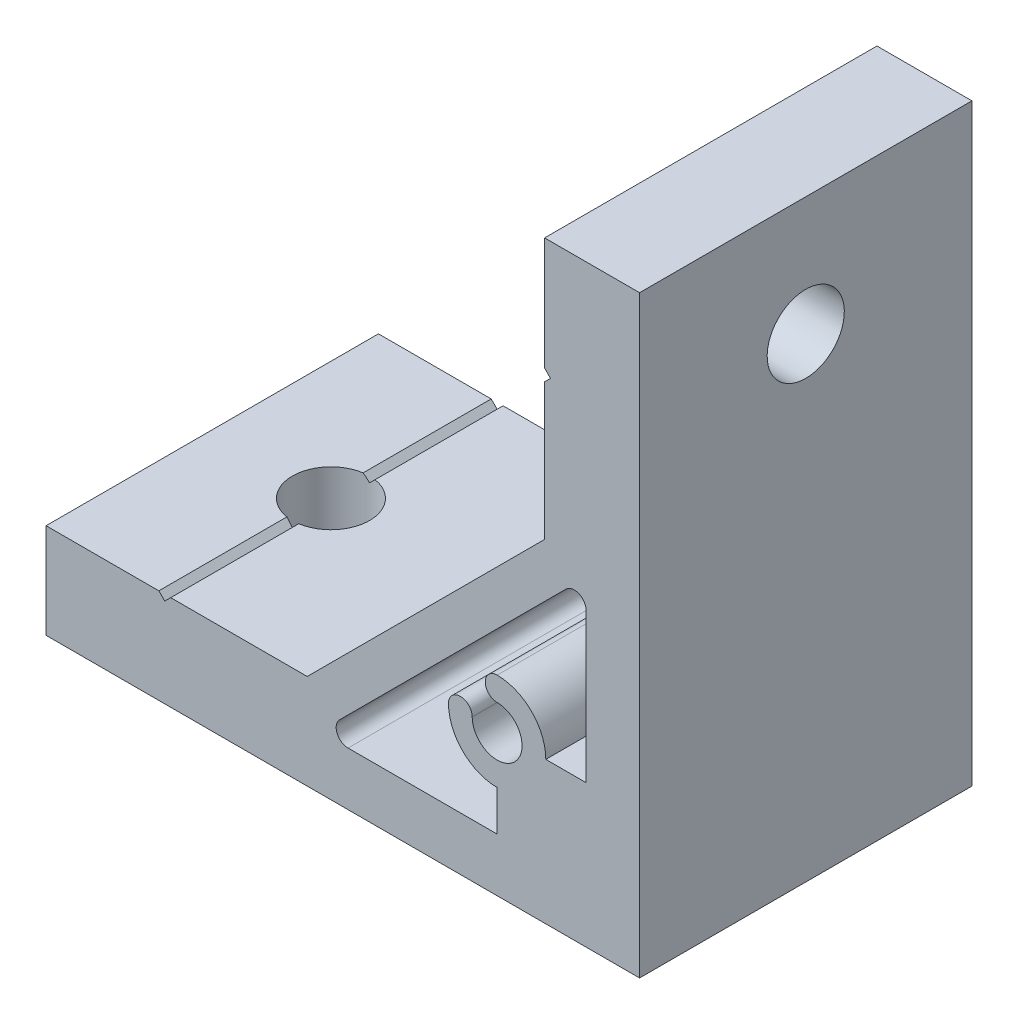
ISO-10303-21;
HEADER;
FILE_DESCRIPTION(('STEP AP214'),'2;1');
FILE_NAME('part.step','',(''),(''),'','','');
FILE_SCHEMA(('AUTOMOTIVE_DESIGN { 1 0 10303 214 1 1 1 1 }'));
ENDSEC;
DATA;
#1=APPLICATION_CONTEXT('core data for automotive mechanical design processes');
#2=APPLICATION_PROTOCOL_DEFINITION('international standard','automotive_design',2000,#1);
#3=PRODUCT_CONTEXT('',#1,'mechanical');
#4=PRODUCT('Part','Part','',(#3));
#5=PRODUCT_RELATED_PRODUCT_CATEGORY('part','',(#4));
#6=PRODUCT_DEFINITION_FORMATION('','',#4);
#7=PRODUCT_DEFINITION_CONTEXT('part definition',#1,'design');
#8=PRODUCT_DEFINITION('design','',#6,#7);
#9=PRODUCT_DEFINITION_SHAPE('','',#8);
#10=(LENGTH_UNIT() NAMED_UNIT(*) SI_UNIT(.MILLI.,.METRE.));
#11=(NAMED_UNIT(*) PLANE_ANGLE_UNIT() SI_UNIT($,.RADIAN.));
#12=(NAMED_UNIT(*) SI_UNIT($,.STERADIAN.) SOLID_ANGLE_UNIT());
#13=UNCERTAINTY_MEASURE_WITH_UNIT(LENGTH_MEASURE(1.E-05),#10,'distance_accuracy_value','');
#14=(GEOMETRIC_REPRESENTATION_CONTEXT(3) GLOBAL_UNCERTAINTY_ASSIGNED_CONTEXT((#13)) GLOBAL_UNIT_ASSIGNED_CONTEXT((#10,
#11,#12)) REPRESENTATION_CONTEXT('',''));
#15=CARTESIAN_POINT('',(0.,0.,0.));
#16=DIRECTION('',(0.,0.,1.));
#17=DIRECTION('',(1.,0.,0.));
#18=AXIS2_PLACEMENT_3D('',#15,#16,#17);
#19=CARTESIAN_POINT('',(-39.5,8.00000000000008,14.));
#20=DIRECTION('',(0.707106781186548,-0.707106781186548,0.));
#21=DIRECTION('',(0.707106781186548,0.707106781186548,0.));
#22=AXIS2_PLACEMENT_3D('',#19,#20,#21);
#23=PLANE('',#22);
#24=DIRECTION('',(0.,0.,-1.));
#25=VECTOR('',#24,1.);
#26=CARTESIAN_POINT('',(-39.5,8.00000000000008,14.));
#27=LINE('',#26,#25);
#28=CARTESIAN_POINT('',(-39.5,8.00000000000008,14.));
#29=VERTEX_POINT('',#28);
#30=CARTESIAN_POINT('',(-39.5,8.00000000000009,3.21130814466628));
#31=VERTEX_POINT('',#30);
#32=EDGE_CURVE('E264',#29,#31,#27,.T.);
#33=ORIENTED_EDGE('',*,*,#32,.T.);
#34=CARTESIAN_POINT('',(-40.,7.50000000000008,0.));
#35=DIRECTION('',(0.707106781186548,-0.707106781186548,0.));
#36=DIRECTION('',(0.707106781186548,0.707106781186548,0.));
#37=AXIS2_PLACEMENT_3D('',#34,#35,#36);
#38=ELLIPSE('',#37,4.59619407771252,3.25);
#39=CARTESIAN_POINT('',(-40.,7.50000000000008,3.25));
#40=VERTEX_POINT('',#39);
#41=EDGE_CURVE('E249',#31,#40,#38,.T.);
#42=ORIENTED_EDGE('',*,*,#41,.T.);
#43=DIRECTION('',(0.,0.,-1.));
#44=VECTOR('',#43,1.);
#45=CARTESIAN_POINT('',(-40.,7.50000000000008,14.));
#46=LINE('',#45,#44);
#47=CARTESIAN_POINT('',(-40.,7.50000000000008,14.));
#48=VERTEX_POINT('',#47);
#49=EDGE_CURVE('E248',#48,#40,#46,.T.);
#50=ORIENTED_EDGE('',*,*,#49,.F.);
#51=DIRECTION('',(-0.707106781186547,-0.707106781186547,0.));
#52=VECTOR('',#51,1.);
#53=CARTESIAN_POINT('',(-39.5,8.00000000000008,14.));
#54=LINE('',#53,#52);
#55=EDGE_CURVE('E365',#29,#48,#54,.T.);
#56=ORIENTED_EDGE('',*,*,#55,.F.);
#57=EDGE_LOOP('',(#33,#42,#50,#56));
#58=FACE_BOUND('',#57,.T.);
#59=ADVANCED_FACE('F34',(#58),#23,.F.);
#60=CARTESIAN_POINT('',(-40.,7.50000000000008,14.));
#61=DIRECTION('',(-0.707106781186549,-0.707106781186546,0.));
#62=DIRECTION('',(0.707106781186546,-0.707106781186549,0.));
#63=AXIS2_PLACEMENT_3D('',#60,#61,#62);
#64=PLANE('',#63);
#65=DIRECTION('',(0.,0.,-1.));
#66=VECTOR('',#65,1.);
#67=CARTESIAN_POINT('',(-40.5,8.00000000000008,14.));
#68=LINE('',#67,#66);
#69=CARTESIAN_POINT('',(-40.5,8.00000000000008,-3.21130814466628));
#70=VERTEX_POINT('',#69);
#71=CARTESIAN_POINT('',(-40.5,8.00000000000008,-14.));
#72=VERTEX_POINT('',#71);
#73=EDGE_CURVE('E256',#70,#72,#68,.T.);
#74=ORIENTED_EDGE('',*,*,#73,.F.);
#75=CARTESIAN_POINT('',(-40.,7.50000000000007,0.));
#76=DIRECTION('',(-0.707106781186549,-0.707106781186546,0.));
#77=DIRECTION('',(-0.707106781186546,0.707106781186549,0.));
#78=AXIS2_PLACEMENT_3D('',#75,#76,#77);
#79=ELLIPSE('',#78,4.59619407771261,3.25);
#80=CARTESIAN_POINT('',(-40.,7.50000000000008,-3.25));
#81=VERTEX_POINT('',#80);
#82=EDGE_CURVE('E49',#70,#81,#79,.T.);
#83=ORIENTED_EDGE('',*,*,#82,.T.);
#84=CARTESIAN_POINT('',(-40.,7.50000000000008,-14.));
#85=VERTEX_POINT('',#84);
#86=EDGE_CURVE('E255',#81,#85,#46,.T.);
#87=ORIENTED_EDGE('',*,*,#86,.T.);
#88=DIRECTION('',(-0.707106781186546,0.707106781186549,0.));
#89=VECTOR('',#88,1.);
#90=CARTESIAN_POINT('',(-40.,7.50000000000008,-14.));
#91=LINE('',#90,#89);
#92=EDGE_CURVE('E332',#85,#72,#91,.T.);
#93=ORIENTED_EDGE('',*,*,#92,.T.);
#94=EDGE_LOOP('',(#74,#83,#87,#93));
#95=FACE_BOUND('',#94,.T.);
#96=ADVANCED_FACE('F414',(#95),#64,.F.);
#97=CARTESIAN_POINT('',(-8.00000000000042,40.5,14.));
#98=DIRECTION('',(0.707106781186549,0.707106781186546,0.));
#99=DIRECTION('',(-0.707106781186546,0.707106781186549,0.));
#100=AXIS2_PLACEMENT_3D('',#97,#98,#99);
#101=PLANE('',#100);
#102=DIRECTION('',(0.,0.,-1.));
#103=VECTOR('',#102,1.);
#104=CARTESIAN_POINT('',(-8.00000000000042,40.5,14.));
#105=LINE('',#104,#103);
#106=CARTESIAN_POINT('',(-8.00000000000042,40.5,14.));
#107=VERTEX_POINT('',#106);
#108=CARTESIAN_POINT('',(-8.00000000000042,40.5,3.21130814466629));
#109=VERTEX_POINT('',#108);
#110=EDGE_CURVE('E282',#107,#109,#105,.T.);
#111=ORIENTED_EDGE('',*,*,#110,.T.);
#112=CARTESIAN_POINT('',(-7.50000000000042,40.,0.));
#113=DIRECTION('',(0.707106781186549,0.707106781186546,0.));
#114=DIRECTION('',(-0.707106781186546,0.707106781186549,0.));
#115=AXIS2_PLACEMENT_3D('',#112,#113,#114);
#116=ELLIPSE('',#115,4.59619407771271,3.25);
#117=CARTESIAN_POINT('',(-7.50000000000042,40.,3.25));
#118=VERTEX_POINT('',#117);
#119=EDGE_CURVE('E452',#109,#118,#116,.T.);
#120=ORIENTED_EDGE('',*,*,#119,.T.);
#121=DIRECTION('',(0.,0.,-1.));
#122=VECTOR('',#121,1.);
#123=CARTESIAN_POINT('',(-7.50000000000042,40.,14.));
#124=LINE('',#123,#122);
#125=CARTESIAN_POINT('',(-7.50000000000042,40.,14.));
#126=VERTEX_POINT('',#125);
#127=EDGE_CURVE('E278',#126,#118,#124,.T.);
#128=ORIENTED_EDGE('',*,*,#127,.F.);
#129=DIRECTION('',(0.707106781186546,-0.707106781186549,0.));
#130=VECTOR('',#129,1.);
#131=CARTESIAN_POINT('',(-8.00000000000042,40.5,14.));
#132=LINE('',#131,#130);
#133=EDGE_CURVE('E355',#107,#126,#132,.T.);
#134=ORIENTED_EDGE('',*,*,#133,.F.);
#135=EDGE_LOOP('',(#111,#120,#128,#134));
#136=FACE_BOUND('',#135,.T.);
#137=ADVANCED_FACE('F421',(#136),#101,.F.);
#138=CARTESIAN_POINT('',(-7.50000000000042,40.,14.));
#139=DIRECTION('',(0.707106781186549,-0.707106781186546,0.));
#140=DIRECTION('',(0.707106781186546,0.707106781186549,0.));
#141=AXIS2_PLACEMENT_3D('',#138,#139,#140);
#142=PLANE('',#141);
#143=DIRECTION('',(0.,0.,-1.));
#144=VECTOR('',#143,1.);
#145=CARTESIAN_POINT('',(-8.00000000000042,39.5,14.));
#146=LINE('',#145,#144);
#147=CARTESIAN_POINT('',(-8.00000000000042,39.5,-3.21130814466628));
#148=VERTEX_POINT('',#147);
#149=CARTESIAN_POINT('',(-8.00000000000042,39.5,-14.));
#150=VERTEX_POINT('',#149);
#151=EDGE_CURVE('E273',#148,#150,#146,.T.);
#152=ORIENTED_EDGE('',*,*,#151,.F.);
#153=CARTESIAN_POINT('',(-7.50000000000043,40.,0.));
#154=DIRECTION('',(0.707106781186549,-0.707106781186546,0.));
#155=DIRECTION('',(-0.707106781186546,-0.707106781186549,0.));
#156=AXIS2_PLACEMENT_3D('',#153,#154,#155);
#157=ELLIPSE('',#156,4.59619407771239,3.25);
#158=CARTESIAN_POINT('',(-7.50000000000042,40.,-3.25));
#159=VERTEX_POINT('',#158);
#160=EDGE_CURVE('E56',#148,#159,#157,.T.);
#161=ORIENTED_EDGE('',*,*,#160,.T.);
#162=CARTESIAN_POINT('',(-7.50000000000042,40.,-14.));
#163=VERTEX_POINT('',#162);
#164=EDGE_CURVE('E277',#159,#163,#124,.T.);
#165=ORIENTED_EDGE('',*,*,#164,.T.);
#166=DIRECTION('',(-0.707106781186546,-0.707106781186549,0.));
#167=VECTOR('',#166,1.);
#168=CARTESIAN_POINT('',(-7.50000000000042,40.,-14.));
#169=LINE('',#168,#167);
#170=EDGE_CURVE('E307',#163,#150,#169,.T.);
#171=ORIENTED_EDGE('',*,*,#170,.T.);
#172=EDGE_LOOP('',(#152,#161,#165,#171));
#173=FACE_BOUND('',#172,.T.);
#174=ADVANCED_FACE('F304',(#173),#142,.F.);
#175=CARTESIAN_POINT('',(0.,0.,14.));
#176=DIRECTION('',(0.,0.,1.));
#177=DIRECTION('',(1.,0.,0.));
#178=AXIS2_PLACEMENT_3D('',#175,#176,#177);
#179=PLANE('',#178);
#180=DIRECTION('',(0.,-1.,0.));
#181=VECTOR('',#180,1.);
#182=CARTESIAN_POINT('',(-50.,8.,14.));
#183=LINE('',#182,#181);
#184=CARTESIAN_POINT('',(-50.,8.,14.));
#185=VERTEX_POINT('',#184);
#186=CARTESIAN_POINT('',(-50.,0.,14.));
#187=VERTEX_POINT('',#186);
#188=EDGE_CURVE('E335',#185,#187,#183,.T.);
#189=ORIENTED_EDGE('',*,*,#188,.T.);
#190=DIRECTION('',(1.,0.,0.));
#191=VECTOR('',#190,1.);
#192=CARTESIAN_POINT('',(-50.,0.,14.));
#193=LINE('',#192,#191);
#194=CARTESIAN_POINT('',(0.,0.,14.));
#195=VERTEX_POINT('',#194);
#196=EDGE_CURVE('E339',#187,#195,#193,.T.);
#197=ORIENTED_EDGE('',*,*,#196,.T.);
#198=DIRECTION('',(0.,1.,0.));
#199=VECTOR('',#198,1.);
#200=CARTESIAN_POINT('',(0.,0.,14.));
#201=LINE('',#200,#199);
#202=CARTESIAN_POINT('',(0.,50.,14.));
#203=VERTEX_POINT('',#202);
#204=EDGE_CURVE('E344',#195,#203,#201,.T.);
#205=ORIENTED_EDGE('',*,*,#204,.T.);
#206=DIRECTION('',(-1.,0.,0.));
#207=VECTOR('',#206,1.);
#208=CARTESIAN_POINT('',(0.,50.,14.));
#209=LINE('',#208,#207);
#210=CARTESIAN_POINT('',(-8.00000000000009,50.,14.));
#211=VERTEX_POINT('',#210);
#212=EDGE_CURVE('E351',#203,#211,#209,.T.);
#213=ORIENTED_EDGE('',*,*,#212,.T.);
#214=DIRECTION('',(0.,-1.,0.));
#215=VECTOR('',#214,1.);
#216=CARTESIAN_POINT('',(-8.00000000000009,50.,14.));
#217=LINE('',#216,#215);
#218=EDGE_CURVE('E353',#211,#107,#217,.T.);
#219=ORIENTED_EDGE('',*,*,#218,.T.);
#220=ORIENTED_EDGE('',*,*,#133,.T.);
#221=DIRECTION('',(-0.707106781186546,-0.707106781186549,0.));
#222=VECTOR('',#221,1.);
#223=CARTESIAN_POINT('',(-7.50000000000042,40.,14.));
#224=LINE('',#223,#222);
#225=CARTESIAN_POINT('',(-8.00000000000042,39.5,14.));
#226=VERTEX_POINT('',#225);
#227=EDGE_CURVE('E357',#126,#226,#224,.T.);
#228=ORIENTED_EDGE('',*,*,#227,.T.);
#229=DIRECTION('',(0.,-1.,0.));
#230=VECTOR('',#229,1.);
#231=CARTESIAN_POINT('',(-8.00000000000042,39.5,14.));
#232=LINE('',#231,#230);
#233=CARTESIAN_POINT('',(-8.00000000000017,28.,14.));
#234=VERTEX_POINT('',#233);
#235=EDGE_CURVE('E359',#226,#234,#232,.T.);
#236=ORIENTED_EDGE('',*,*,#235,.T.);
#237=DIRECTION('',(-0.707106781186546,-0.707106781186549,0.));
#238=VECTOR('',#237,1.);
#239=CARTESIAN_POINT('',(-8.00000000000017,28.,14.));
#240=LINE('',#239,#238);
#241=CARTESIAN_POINT('',(-28.,8.00000000000008,14.));
#242=VERTEX_POINT('',#241);
#243=EDGE_CURVE('E361',#234,#242,#240,.T.);
#244=ORIENTED_EDGE('',*,*,#243,.T.);
#245=DIRECTION('',(-1.,0.,0.));
#246=VECTOR('',#245,1.);
#247=CARTESIAN_POINT('',(-28.,8.00000000000008,14.));
#248=LINE('',#247,#246);
#249=EDGE_CURVE('E363',#242,#29,#248,.T.);
#250=ORIENTED_EDGE('',*,*,#249,.T.);
#251=ORIENTED_EDGE('',*,*,#55,.T.);
#252=DIRECTION('',(-0.707106781186546,0.707106781186549,0.));
#253=VECTOR('',#252,1.);
#254=CARTESIAN_POINT('',(-40.,7.50000000000008,14.));
#255=LINE('',#254,#253);
#256=CARTESIAN_POINT('',(-40.5,8.00000000000008,14.));
#257=VERTEX_POINT('',#256);
#258=EDGE_CURVE('E367',#48,#257,#255,.T.);
#259=ORIENTED_EDGE('',*,*,#258,.T.);
#260=DIRECTION('',(-1.,0.,0.));
#261=VECTOR('',#260,1.);
#262=CARTESIAN_POINT('',(-40.5,8.00000000000008,14.));
#263=LINE('',#262,#261);
#264=EDGE_CURVE('E254',#257,#185,#263,.T.);
#265=ORIENTED_EDGE('',*,*,#264,.T.);
#266=EDGE_LOOP('',(#189,#197,#205,#213,#219,#220,#228,#236,#244,#250,#251,#259,#265));
#267=FACE_BOUND('',#266,.T.);
#268=DIRECTION('',(0.,1.,0.));
#269=VECTOR('',#268,1.);
#270=CARTESIAN_POINT('',(-4.5,12.,14.));
#271=LINE('',#270,#269);
#272=CARTESIAN_POINT('',(-4.5,12.,14.));
#273=VERTEX_POINT('',#272);
#274=CARTESIAN_POINT('',(-4.5,24.5603030380332,14.));
#275=VERTEX_POINT('',#274);
#276=EDGE_CURVE('E458',#273,#275,#271,.T.);
#277=ORIENTED_EDGE('',*,*,#276,.F.);
#278=DIRECTION('',(1.,0.,0.));
#279=VECTOR('',#278,1.);
#280=CARTESIAN_POINT('',(-7.9,12.,14.));
#281=LINE('',#280,#279);
#282=CARTESIAN_POINT('',(-7.9,12.,14.));
#283=VERTEX_POINT('',#282);
#284=EDGE_CURVE('E456',#283,#273,#281,.T.);
#285=ORIENTED_EDGE('',*,*,#284,.F.);
#286=CARTESIAN_POINT('',(-12.,12.,14.));
#287=DIRECTION('',(0.,0.,-1.));
#288=DIRECTION('',(-1.,0.,0.));
#289=AXIS2_PLACEMENT_3D('',#286,#287,#288);
#290=CIRCLE('',#289,4.1);
#291=CARTESIAN_POINT('',(-12.,16.1,14.));
#292=VERTEX_POINT('',#291);
#293=EDGE_CURVE('E480',#292,#283,#290,.T.);
#294=ORIENTED_EDGE('',*,*,#293,.F.);
#295=CARTESIAN_POINT('',(-12.,15.1,14.));
#296=DIRECTION('',(0.,0.,-1.));
#297=DIRECTION('',(-1.,0.,0.));
#298=AXIS2_PLACEMENT_3D('',#295,#296,#297);
#299=CIRCLE('',#298,1.);
#300=CARTESIAN_POINT('',(-12.,14.1,14.));
#301=VERTEX_POINT('',#300);
#302=EDGE_CURVE('E477',#301,#292,#299,.T.);
#303=ORIENTED_EDGE('',*,*,#302,.F.);
#304=CARTESIAN_POINT('',(-12.,12.,14.));
#305=DIRECTION('',(0.,0.,1.));
#306=DIRECTION('',(1.,0.,0.));
#307=AXIS2_PLACEMENT_3D('',#304,#305,#306);
#308=CIRCLE('',#307,2.1);
#309=CARTESIAN_POINT('',(-14.1,12.,14.));
#310=VERTEX_POINT('',#309);
#311=EDGE_CURVE('E475',#310,#301,#308,.T.);
#312=ORIENTED_EDGE('',*,*,#311,.F.);
#313=CARTESIAN_POINT('',(-15.1,12.,14.));
#314=DIRECTION('',(0.,0.,-1.));
#315=DIRECTION('',(-1.,0.,0.));
#316=AXIS2_PLACEMENT_3D('',#313,#314,#315);
#317=CIRCLE('',#316,1.);
#318=CARTESIAN_POINT('',(-16.1,12.,14.));
#319=VERTEX_POINT('',#318);
#320=EDGE_CURVE('E473',#319,#310,#317,.T.);
#321=ORIENTED_EDGE('',*,*,#320,.F.);
#322=CARTESIAN_POINT('',(-12.,12.,14.));
#323=DIRECTION('',(0.,0.,-1.));
#324=DIRECTION('',(-1.,0.,0.));
#325=AXIS2_PLACEMENT_3D('',#322,#323,#324);
#326=CIRCLE('',#325,4.1);
#327=CARTESIAN_POINT('',(-12.,7.9,14.));
#328=VERTEX_POINT('',#327);
#329=EDGE_CURVE('E471',#328,#319,#326,.T.);
#330=ORIENTED_EDGE('',*,*,#329,.F.);
#331=DIRECTION('',(0.,1.,0.));
#332=VECTOR('',#331,1.);
#333=CARTESIAN_POINT('',(-12.,4.5,14.));
#334=LINE('',#333,#332);
#335=CARTESIAN_POINT('',(-12.,4.5,14.));
#336=VERTEX_POINT('',#335);
#337=EDGE_CURVE('E469',#336,#328,#334,.T.);
#338=ORIENTED_EDGE('',*,*,#337,.F.);
#339=DIRECTION('',(1.,0.,0.));
#340=VECTOR('',#339,1.);
#341=CARTESIAN_POINT('',(-24.5603030380331,4.5,14.));
#342=LINE('',#341,#340);
#343=CARTESIAN_POINT('',(-24.5603030380331,4.5,14.));
#344=VERTEX_POINT('',#343);
#345=EDGE_CURVE('E467',#344,#336,#342,.T.);
#346=ORIENTED_EDGE('',*,*,#345,.F.);
#347=CARTESIAN_POINT('',(-24.5603030380331,5.5,14.));
#348=DIRECTION('',(0.,0.,1.));
#349=DIRECTION('',(1.,0.,0.));
#350=AXIS2_PLACEMENT_3D('',#347,#348,#349);
#351=CIRCLE('',#350,1.);
#352=CARTESIAN_POINT('',(-25.2674098192196,6.20710678118655,14.));
#353=VERTEX_POINT('',#352);
#354=EDGE_CURVE('E465',#353,#344,#351,.T.);
#355=ORIENTED_EDGE('',*,*,#354,.F.);
#356=DIRECTION('',(-0.707106781186546,-0.707106781186549,0.));
#357=VECTOR('',#356,1.);
#358=CARTESIAN_POINT('',(-6.20710678118655,25.2674098192197,14.));
#359=LINE('',#358,#357);
#360=CARTESIAN_POINT('',(-6.20710678118655,25.2674098192197,14.));
#361=VERTEX_POINT('',#360);
#362=EDGE_CURVE('E463',#361,#353,#359,.T.);
#363=ORIENTED_EDGE('',*,*,#362,.F.);
#364=CARTESIAN_POINT('',(-5.5,24.5603030380332,14.));
#365=DIRECTION('',(0.,0.,1.));
#366=DIRECTION('',(1.,0.,0.));
#367=AXIS2_PLACEMENT_3D('',#364,#365,#366);
#368=CIRCLE('',#367,0.999999999999999);
#369=EDGE_CURVE('E461',#275,#361,#368,.T.);
#370=ORIENTED_EDGE('',*,*,#369,.F.);
#371=EDGE_LOOP('',(#277,#285,#294,#303,#312,#321,#330,#338,#346,#355,#363,#370));
#372=FACE_BOUND('',#371,.T.);
#373=ADVANCED_FACE('F411',(#267,#372),#179,.T.);
#374=CARTESIAN_POINT('',(0.,0.,-14.));
#375=DIRECTION('',(0.,0.,1.));
#376=DIRECTION('',(1.,0.,0.));
#377=AXIS2_PLACEMENT_3D('',#374,#375,#376);
#378=PLANE('',#377);
#379=DIRECTION('',(0.,-1.,0.));
#380=VECTOR('',#379,1.);
#381=CARTESIAN_POINT('',(-50.,8.,-14.));
#382=LINE('',#381,#380);
#383=CARTESIAN_POINT('',(-50.,8.,-14.));
#384=VERTEX_POINT('',#383);
#385=CARTESIAN_POINT('',(-50.,0.,-14.));
#386=VERTEX_POINT('',#385);
#387=EDGE_CURVE('E370',#384,#386,#382,.T.);
#388=ORIENTED_EDGE('',*,*,#387,.F.);
#389=DIRECTION('',(-1.,0.,0.));
#390=VECTOR('',#389,1.);
#391=CARTESIAN_POINT('',(-40.5,8.00000000000008,-14.));
#392=LINE('',#391,#390);
#393=EDGE_CURVE('E334',#72,#384,#392,.T.);
#394=ORIENTED_EDGE('',*,*,#393,.F.);
#395=ORIENTED_EDGE('',*,*,#92,.F.);
#396=DIRECTION('',(-0.707106781186547,-0.707106781186547,0.));
#397=VECTOR('',#396,1.);
#398=CARTESIAN_POINT('',(-39.5,8.00000000000008,-14.));
#399=LINE('',#398,#397);
#400=CARTESIAN_POINT('',(-39.5,8.00000000000008,-14.));
#401=VERTEX_POINT('',#400);
#402=EDGE_CURVE('E329',#401,#85,#399,.T.);
#403=ORIENTED_EDGE('',*,*,#402,.F.);
#404=DIRECTION('',(-1.,0.,0.));
#405=VECTOR('',#404,1.);
#406=CARTESIAN_POINT('',(-28.,8.00000000000008,-14.));
#407=LINE('',#406,#405);
#408=CARTESIAN_POINT('',(-28.,8.00000000000008,-14.));
#409=VERTEX_POINT('',#408);
#410=EDGE_CURVE('E323',#409,#401,#407,.T.);
#411=ORIENTED_EDGE('',*,*,#410,.F.);
#412=DIRECTION('',(-0.707106781186546,-0.707106781186549,0.));
#413=VECTOR('',#412,1.);
#414=CARTESIAN_POINT('',(-8.00000000000017,28.,-14.));
#415=LINE('',#414,#413);
#416=CARTESIAN_POINT('',(-8.00000000000017,28.,-14.));
#417=VERTEX_POINT('',#416);
#418=EDGE_CURVE('E320',#417,#409,#415,.T.);
#419=ORIENTED_EDGE('',*,*,#418,.F.);
#420=DIRECTION('',(0.,-1.,0.));
#421=VECTOR('',#420,1.);
#422=CARTESIAN_POINT('',(-8.00000000000042,39.5,-14.));
#423=LINE('',#422,#421);
#424=EDGE_CURVE('E312',#150,#417,#423,.T.);
#425=ORIENTED_EDGE('',*,*,#424,.F.);
#426=ORIENTED_EDGE('',*,*,#170,.F.);
#427=DIRECTION('',(0.707106781186546,-0.707106781186549,0.));
#428=VECTOR('',#427,1.);
#429=CARTESIAN_POINT('',(-8.00000000000042,40.5,-14.));
#430=LINE('',#429,#428);
#431=CARTESIAN_POINT('',(-8.00000000000042,40.5,-14.));
#432=VERTEX_POINT('',#431);
#433=EDGE_CURVE('E313',#432,#163,#430,.T.);
#434=ORIENTED_EDGE('',*,*,#433,.F.);
#435=DIRECTION('',(0.,-1.,0.));
#436=VECTOR('',#435,1.);
#437=CARTESIAN_POINT('',(-8.00000000000009,50.,-14.));
#438=LINE('',#437,#436);
#439=CARTESIAN_POINT('',(-8.00000000000009,50.,-14.));
#440=VERTEX_POINT('',#439);
#441=EDGE_CURVE('E379',#440,#432,#438,.T.);
#442=ORIENTED_EDGE('',*,*,#441,.F.);
#443=DIRECTION('',(-1.,0.,0.));
#444=VECTOR('',#443,1.);
#445=CARTESIAN_POINT('',(0.,50.,-14.));
#446=LINE('',#445,#444);
#447=CARTESIAN_POINT('',(0.,50.,-14.));
#448=VERTEX_POINT('',#447);
#449=EDGE_CURVE('E377',#448,#440,#446,.T.);
#450=ORIENTED_EDGE('',*,*,#449,.F.);
#451=DIRECTION('',(0.,1.,0.));
#452=VECTOR('',#451,1.);
#453=CARTESIAN_POINT('',(0.,0.,-14.));
#454=LINE('',#453,#452);
#455=CARTESIAN_POINT('',(0.,0.,-14.));
#456=VERTEX_POINT('',#455);
#457=EDGE_CURVE('E375',#456,#448,#454,.T.);
#458=ORIENTED_EDGE('',*,*,#457,.F.);
#459=DIRECTION('',(1.,0.,0.));
#460=VECTOR('',#459,1.);
#461=CARTESIAN_POINT('',(-50.,0.,-14.));
#462=LINE('',#461,#460);
#463=EDGE_CURVE('E373',#386,#456,#462,.T.);
#464=ORIENTED_EDGE('',*,*,#463,.F.);
#465=EDGE_LOOP('',(#388,#394,#395,#403,#411,#419,#425,#426,#434,#442,#450,#458,#464));
#466=FACE_BOUND('',#465,.T.);
#467=DIRECTION('',(1.,0.,0.));
#468=VECTOR('',#467,1.);
#469=CARTESIAN_POINT('',(-7.9,12.,-14.));
#470=LINE('',#469,#468);
#471=CARTESIAN_POINT('',(-7.9,12.,-14.));
#472=VERTEX_POINT('',#471);
#473=CARTESIAN_POINT('',(-4.5,12.,-14.));
#474=VERTEX_POINT('',#473);
#475=EDGE_CURVE('E483',#472,#474,#470,.T.);
#476=ORIENTED_EDGE('',*,*,#475,.T.);
#477=DIRECTION('',(0.,1.,0.));
#478=VECTOR('',#477,1.);
#479=CARTESIAN_POINT('',(-4.5,12.,-14.));
#480=LINE('',#479,#478);
#481=CARTESIAN_POINT('',(-4.5,24.5603030380332,-14.));
#482=VERTEX_POINT('',#481);
#483=EDGE_CURVE('E486',#474,#482,#480,.T.);
#484=ORIENTED_EDGE('',*,*,#483,.T.);
#485=CARTESIAN_POINT('',(-5.5,24.5603030380332,-14.));
#486=DIRECTION('',(0.,0.,1.));
#487=DIRECTION('',(1.,0.,0.));
#488=AXIS2_PLACEMENT_3D('',#485,#486,#487);
#489=CIRCLE('',#488,0.999999999999999);
#490=CARTESIAN_POINT('',(-6.20710678118655,25.2674098192197,-14.));
#491=VERTEX_POINT('',#490);
#492=EDGE_CURVE('E489',#482,#491,#489,.T.);
#493=ORIENTED_EDGE('',*,*,#492,.T.);
#494=DIRECTION('',(-0.707106781186546,-0.707106781186549,0.));
#495=VECTOR('',#494,1.);
#496=CARTESIAN_POINT('',(-6.20710678118655,25.2674098192197,-14.));
#497=LINE('',#496,#495);
#498=CARTESIAN_POINT('',(-25.2674098192196,6.20710678118655,-14.));
#499=VERTEX_POINT('',#498);
#500=EDGE_CURVE('E492',#491,#499,#497,.T.);
#501=ORIENTED_EDGE('',*,*,#500,.T.);
#502=CARTESIAN_POINT('',(-24.5603030380331,5.5,-14.));
#503=DIRECTION('',(0.,0.,1.));
#504=DIRECTION('',(1.,0.,0.));
#505=AXIS2_PLACEMENT_3D('',#502,#503,#504);
#506=CIRCLE('',#505,1.);
#507=CARTESIAN_POINT('',(-24.5603030380331,4.5,-14.));
#508=VERTEX_POINT('',#507);
#509=EDGE_CURVE('E495',#499,#508,#506,.T.);
#510=ORIENTED_EDGE('',*,*,#509,.T.);
#511=DIRECTION('',(1.,0.,0.));
#512=VECTOR('',#511,1.);
#513=CARTESIAN_POINT('',(-24.5603030380331,4.5,-14.));
#514=LINE('',#513,#512);
#515=CARTESIAN_POINT('',(-12.,4.5,-14.));
#516=VERTEX_POINT('',#515);
#517=EDGE_CURVE('E498',#508,#516,#514,.T.);
#518=ORIENTED_EDGE('',*,*,#517,.T.);
#519=DIRECTION('',(0.,1.,0.));
#520=VECTOR('',#519,1.);
#521=CARTESIAN_POINT('',(-12.,4.5,-14.));
#522=LINE('',#521,#520);
#523=CARTESIAN_POINT('',(-12.,7.9,-14.));
#524=VERTEX_POINT('',#523);
#525=EDGE_CURVE('E501',#516,#524,#522,.T.);
#526=ORIENTED_EDGE('',*,*,#525,.T.);
#527=CARTESIAN_POINT('',(-12.,12.,-14.));
#528=DIRECTION('',(0.,0.,-1.));
#529=DIRECTION('',(-1.,0.,0.));
#530=AXIS2_PLACEMENT_3D('',#527,#528,#529);
#531=CIRCLE('',#530,4.1);
#532=CARTESIAN_POINT('',(-16.1,12.,-14.));
#533=VERTEX_POINT('',#532);
#534=EDGE_CURVE('E504',#524,#533,#531,.T.);
#535=ORIENTED_EDGE('',*,*,#534,.T.);
#536=CARTESIAN_POINT('',(-15.1,12.,-14.));
#537=DIRECTION('',(0.,0.,-1.));
#538=DIRECTION('',(-1.,0.,0.));
#539=AXIS2_PLACEMENT_3D('',#536,#537,#538);
#540=CIRCLE('',#539,1.);
#541=CARTESIAN_POINT('',(-14.1,12.,-14.));
#542=VERTEX_POINT('',#541);
#543=EDGE_CURVE('E507',#533,#542,#540,.T.);
#544=ORIENTED_EDGE('',*,*,#543,.T.);
#545=CARTESIAN_POINT('',(-12.,12.,-14.));
#546=DIRECTION('',(0.,0.,1.));
#547=DIRECTION('',(1.,0.,0.));
#548=AXIS2_PLACEMENT_3D('',#545,#546,#547);
#549=CIRCLE('',#548,2.1);
#550=CARTESIAN_POINT('',(-12.,14.1,-14.));
#551=VERTEX_POINT('',#550);
#552=EDGE_CURVE('E510',#542,#551,#549,.T.);
#553=ORIENTED_EDGE('',*,*,#552,.T.);
#554=CARTESIAN_POINT('',(-12.,15.1,-14.));
#555=DIRECTION('',(0.,0.,-1.));
#556=DIRECTION('',(-1.,0.,0.));
#557=AXIS2_PLACEMENT_3D('',#554,#555,#556);
#558=CIRCLE('',#557,1.);
#559=CARTESIAN_POINT('',(-12.,16.1,-14.));
#560=VERTEX_POINT('',#559);
#561=EDGE_CURVE('E513',#551,#560,#558,.T.);
#562=ORIENTED_EDGE('',*,*,#561,.T.);
#563=CARTESIAN_POINT('',(-12.,12.,-14.));
#564=DIRECTION('',(0.,0.,-1.));
#565=DIRECTION('',(-1.,0.,0.));
#566=AXIS2_PLACEMENT_3D('',#563,#564,#565);
#567=CIRCLE('',#566,4.1);
#568=EDGE_CURVE('E459',#560,#472,#567,.T.);
#569=ORIENTED_EDGE('',*,*,#568,.T.);
#570=EDGE_LOOP('',(#476,#484,#493,#501,#510,#518,#526,#535,#544,#553,#562,#569));
#571=FACE_BOUND('',#570,.T.);
#572=ADVANCED_FACE('F317',(#466,#571),#378,.F.);
#573=CARTESIAN_POINT('',(-50.,8.,14.));
#574=DIRECTION('',(1.,0.,0.));
#575=DIRECTION('',(0.,1.,0.));
#576=AXIS2_PLACEMENT_3D('',#573,#574,#575);
#577=PLANE('',#576);
#578=ORIENTED_EDGE('',*,*,#387,.T.);
#579=DIRECTION('',(0.,0.,-1.));
#580=VECTOR('',#579,1.);
#581=CARTESIAN_POINT('',(-50.,0.,14.));
#582=LINE('',#581,#580);
#583=EDGE_CURVE('E294',#187,#386,#582,.T.);
#584=ORIENTED_EDGE('',*,*,#583,.F.);
#585=ORIENTED_EDGE('',*,*,#188,.F.);
#586=DIRECTION('',(0.,0.,-1.));
#587=VECTOR('',#586,1.);
#588=CARTESIAN_POINT('',(-50.,8.,14.));
#589=LINE('',#588,#587);
#590=EDGE_CURVE('E259',#185,#384,#589,.T.);
#591=ORIENTED_EDGE('',*,*,#590,.T.);
#592=EDGE_LOOP('',(#578,#584,#585,#591));
#593=FACE_BOUND('',#592,.T.);
#594=ADVANCED_FACE('F36',(#593),#577,.F.);
#595=CARTESIAN_POINT('',(-50.,0.,14.));
#596=DIRECTION('',(0.,1.,0.));
#597=DIRECTION('',(-1.,0.,0.));
#598=AXIS2_PLACEMENT_3D('',#595,#596,#597);
#599=PLANE('',#598);
#600=CARTESIAN_POINT('',(-40.,-3.29597460435593E-13,0.));
#601=DIRECTION('',(0.,1.,0.));
#602=DIRECTION('',(-1.,0.,0.));
#603=AXIS2_PLACEMENT_3D('',#600,#601,#602);
#604=CIRCLE('',#603,3.25);
#605=CARTESIAN_POINT('',(-43.25,-3.56303071842079E-13,0.));
#606=VERTEX_POINT('',#605);
#607=EDGE_CURVE('E250',#606,#606,#604,.T.);
#608=ORIENTED_EDGE('',*,*,#607,.T.);
#609=EDGE_LOOP('',(#608));
#610=FACE_BOUND('',#609,.T.);
#611=ORIENTED_EDGE('',*,*,#463,.T.);
#612=DIRECTION('',(0.,0.,-1.));
#613=VECTOR('',#612,1.);
#614=CARTESIAN_POINT('',(0.,0.,14.));
#615=LINE('',#614,#613);
#616=EDGE_CURVE('E291',#195,#456,#615,.T.);
#617=ORIENTED_EDGE('',*,*,#616,.F.);
#618=ORIENTED_EDGE('',*,*,#196,.F.);
#619=ORIENTED_EDGE('',*,*,#583,.T.);
#620=EDGE_LOOP('',(#611,#617,#618,#619));
#621=FACE_BOUND('',#620,.T.);
#622=ADVANCED_FACE('F403',(#610,#621),#599,.F.);
#623=CARTESIAN_POINT('',(0.,0.,14.));
#624=DIRECTION('',(-1.,0.,0.));
#625=DIRECTION('',(0.,0.,1.));
#626=AXIS2_PLACEMENT_3D('',#623,#624,#625);
#627=PLANE('',#626);
#628=CARTESIAN_POINT('',(1.38777878078145E-12,39.9999999999998,0.));
#629=DIRECTION('',(-1.,0.,0.));
#630=DIRECTION('',(0.,-1.,0.));
#631=AXIS2_PLACEMENT_3D('',#628,#629,#630);
#632=CIRCLE('',#631,3.25);
#633=CARTESIAN_POINT('',(1.27502175484295E-12,36.7499999999998,0.));
#634=VERTEX_POINT('',#633);
#635=EDGE_CURVE('E446',#634,#634,#632,.T.);
#636=ORIENTED_EDGE('',*,*,#635,.T.);
#637=EDGE_LOOP('',(#636));
#638=FACE_BOUND('',#637,.T.);
#639=ORIENTED_EDGE('',*,*,#457,.T.);
#640=DIRECTION('',(0.,0.,-1.));
#641=VECTOR('',#640,1.);
#642=CARTESIAN_POINT('',(0.,50.,14.));
#643=LINE('',#642,#641);
#644=EDGE_CURVE('E288',#203,#448,#643,.T.);
#645=ORIENTED_EDGE('',*,*,#644,.F.);
#646=ORIENTED_EDGE('',*,*,#204,.F.);
#647=ORIENTED_EDGE('',*,*,#616,.T.);
#648=EDGE_LOOP('',(#639,#645,#646,#647));
#649=FACE_BOUND('',#648,.T.);
#650=ADVANCED_FACE('F400',(#638,#649),#627,.F.);
#651=CARTESIAN_POINT('',(0.,50.,14.));
#652=DIRECTION('',(0.,-1.,0.));
#653=DIRECTION('',(0.,0.,-1.));
#654=AXIS2_PLACEMENT_3D('',#651,#652,#653);
#655=PLANE('',#654);
#656=ORIENTED_EDGE('',*,*,#449,.T.);
#657=DIRECTION('',(0.,0.,-1.));
#658=VECTOR('',#657,1.);
#659=CARTESIAN_POINT('',(-8.00000000000009,50.,14.));
#660=LINE('',#659,#658);
#661=EDGE_CURVE('E285',#211,#440,#660,.T.);
#662=ORIENTED_EDGE('',*,*,#661,.F.);
#663=ORIENTED_EDGE('',*,*,#212,.F.);
#664=ORIENTED_EDGE('',*,*,#644,.T.);
#665=EDGE_LOOP('',(#656,#662,#663,#664));
#666=FACE_BOUND('',#665,.T.);
#667=ADVANCED_FACE('F396',(#666),#655,.F.);
#668=CARTESIAN_POINT('',(-8.00000000000009,50.,14.));
#669=DIRECTION('',(1.,0.,0.));
#670=DIRECTION('',(0.,1.,0.));
#671=AXIS2_PLACEMENT_3D('',#668,#669,#670);
#672=PLANE('',#671);
#673=CARTESIAN_POINT('',(-8.00000000000042,40.5,-3.21130814466629));
#674=VERTEX_POINT('',#673);
#675=EDGE_CURVE('E281',#674,#432,#105,.T.);
#676=ORIENTED_EDGE('',*,*,#675,.F.);
#677=CARTESIAN_POINT('',(-8.00000000000044,40.0000000000001,0.));
#678=DIRECTION('',(-1.,0.,0.));
#679=DIRECTION('',(0.,-1.,0.));
#680=AXIS2_PLACEMENT_3D('',#677,#678,#679);
#681=CIRCLE('',#680,3.25);
#682=EDGE_CURVE('E440',#109,#674,#681,.T.);
#683=ORIENTED_EDGE('',*,*,#682,.F.);
#684=ORIENTED_EDGE('',*,*,#110,.F.);
#685=ORIENTED_EDGE('',*,*,#218,.F.);
#686=ORIENTED_EDGE('',*,*,#661,.T.);
#687=ORIENTED_EDGE('',*,*,#441,.T.);
#688=EDGE_LOOP('',(#676,#683,#684,#685,#686,#687));
#689=FACE_BOUND('',#688,.T.);
#690=ADVANCED_FACE('F389',(#689),#672,.F.);
#691=ORIENTED_EDGE('',*,*,#164,.F.);
#692=EDGE_CURVE('E455',#159,#674,#116,.T.);
#693=ORIENTED_EDGE('',*,*,#692,.T.);
#694=ORIENTED_EDGE('',*,*,#675,.T.);
#695=ORIENTED_EDGE('',*,*,#433,.T.);
#696=EDGE_LOOP('',(#691,#693,#694,#695));
#697=FACE_BOUND('',#696,.T.);
#698=ADVANCED_FACE('F382',(#697),#101,.F.);
#699=ORIENTED_EDGE('',*,*,#127,.T.);
#700=CARTESIAN_POINT('',(-8.00000000000046,39.5,3.21130814466628));
#701=VERTEX_POINT('',#700);
#702=EDGE_CURVE('E449',#118,#701,#157,.T.);
#703=ORIENTED_EDGE('',*,*,#702,.T.);
#704=EDGE_CURVE('E274',#226,#701,#146,.T.);
#705=ORIENTED_EDGE('',*,*,#704,.F.);
#706=ORIENTED_EDGE('',*,*,#227,.F.);
#707=EDGE_LOOP('',(#699,#703,#705,#706));
#708=FACE_BOUND('',#707,.T.);
#709=ADVANCED_FACE('F706',(#708),#142,.F.);
#710=CARTESIAN_POINT('',(-8.00000000000042,39.5,14.));
#711=DIRECTION('',(1.,0.,0.));
#712=DIRECTION('',(0.,1.,0.));
#713=AXIS2_PLACEMENT_3D('',#710,#711,#712);
#714=PLANE('',#713);
#715=ORIENTED_EDGE('',*,*,#704,.T.);
#716=CARTESIAN_POINT('',(-8.00000000000043,40.0000000000001,0.));
#717=DIRECTION('',(1.,0.,0.));
#718=DIRECTION('',(0.,1.,0.));
#719=AXIS2_PLACEMENT_3D('',#716,#717,#718);
#720=CIRCLE('',#719,3.25);
#721=EDGE_CURVE('E42',#701,#148,#720,.T.);
#722=ORIENTED_EDGE('',*,*,#721,.T.);
#723=ORIENTED_EDGE('',*,*,#151,.T.);
#724=ORIENTED_EDGE('',*,*,#424,.T.);
#725=DIRECTION('',(0.,0.,-1.));
#726=VECTOR('',#725,1.);
#727=CARTESIAN_POINT('',(-8.00000000000017,28.,14.));
#728=LINE('',#727,#726);
#729=EDGE_CURVE('E270',#234,#417,#728,.T.);
#730=ORIENTED_EDGE('',*,*,#729,.F.);
#731=ORIENTED_EDGE('',*,*,#235,.F.);
#732=EDGE_LOOP('',(#715,#722,#723,#724,#730,#731));
#733=FACE_BOUND('',#732,.T.);
#734=ADVANCED_FACE('F298',(#733),#714,.F.);
#735=CARTESIAN_POINT('',(-8.00000000000017,28.,14.));
#736=DIRECTION('',(0.707106781186549,-0.707106781186546,0.));
#737=DIRECTION('',(0.707106781186546,0.707106781186549,0.));
#738=AXIS2_PLACEMENT_3D('',#735,#736,#737);
#739=PLANE('',#738);
#740=ORIENTED_EDGE('',*,*,#418,.T.);
#741=DIRECTION('',(0.,0.,-1.));
#742=VECTOR('',#741,1.);
#743=CARTESIAN_POINT('',(-28.,8.00000000000008,14.));
#744=LINE('',#743,#742);
#745=EDGE_CURVE('E267',#242,#409,#744,.T.);
#746=ORIENTED_EDGE('',*,*,#745,.F.);
#747=ORIENTED_EDGE('',*,*,#243,.F.);
#748=ORIENTED_EDGE('',*,*,#729,.T.);
#749=EDGE_LOOP('',(#740,#746,#747,#748));
#750=FACE_BOUND('',#749,.T.);
#751=ADVANCED_FACE('F432',(#750),#739,.F.);
#752=CARTESIAN_POINT('',(-28.,8.00000000000008,14.));
#753=DIRECTION('',(0.,-1.,0.));
#754=DIRECTION('',(1.,0.,0.));
#755=AXIS2_PLACEMENT_3D('',#752,#753,#754);
#756=PLANE('',#755);
#757=CARTESIAN_POINT('',(-39.5,8.00000000000009,-3.21130814466628));
#758=VERTEX_POINT('',#757);
#759=EDGE_CURVE('E263',#758,#401,#27,.T.);
#760=ORIENTED_EDGE('',*,*,#759,.F.);
#761=CARTESIAN_POINT('',(-40.,8.00000000000008,0.));
#762=DIRECTION('',(0.,1.,0.));
#763=DIRECTION('',(-1.,0.,0.));
#764=AXIS2_PLACEMENT_3D('',#761,#762,#763);
#765=CIRCLE('',#764,3.25);
#766=EDGE_CURVE('E443',#31,#758,#765,.T.);
#767=ORIENTED_EDGE('',*,*,#766,.F.);
#768=ORIENTED_EDGE('',*,*,#32,.F.);
#769=ORIENTED_EDGE('',*,*,#249,.F.);
#770=ORIENTED_EDGE('',*,*,#745,.T.);
#771=ORIENTED_EDGE('',*,*,#410,.T.);
#772=EDGE_LOOP('',(#760,#767,#768,#769,#770,#771));
#773=FACE_BOUND('',#772,.T.);
#774=ADVANCED_FACE('F426',(#773),#756,.F.);
#775=ORIENTED_EDGE('',*,*,#86,.F.);
#776=EDGE_CURVE('E436',#81,#758,#38,.T.);
#777=ORIENTED_EDGE('',*,*,#776,.T.);
#778=ORIENTED_EDGE('',*,*,#759,.T.);
#779=ORIENTED_EDGE('',*,*,#402,.T.);
#780=EDGE_LOOP('',(#775,#777,#778,#779));
#781=FACE_BOUND('',#780,.T.);
#782=ADVANCED_FACE('F417',(#781),#23,.F.);
#783=ORIENTED_EDGE('',*,*,#49,.T.);
#784=CARTESIAN_POINT('',(-40.5,8.00000000000008,3.21130814466628));
#785=VERTEX_POINT('',#784);
#786=EDGE_CURVE('E235',#40,#785,#79,.T.);
#787=ORIENTED_EDGE('',*,*,#786,.T.);
#788=EDGE_CURVE('E245',#257,#785,#68,.T.);
#789=ORIENTED_EDGE('',*,*,#788,.F.);
#790=ORIENTED_EDGE('',*,*,#258,.F.);
#791=EDGE_LOOP('',(#783,#787,#789,#790));
#792=FACE_BOUND('',#791,.T.);
#793=ADVANCED_FACE('F243',(#792),#64,.F.);
#794=CARTESIAN_POINT('',(-40.5,8.00000000000008,14.));
#795=DIRECTION('',(0.,-1.,0.));
#796=DIRECTION('',(1.,0.,0.));
#797=AXIS2_PLACEMENT_3D('',#794,#795,#796);
#798=PLANE('',#797);
#799=ORIENTED_EDGE('',*,*,#788,.T.);
#800=CARTESIAN_POINT('',(-40.,8.00000000000008,0.));
#801=DIRECTION('',(0.,-1.,0.));
#802=DIRECTION('',(1.,0.,0.));
#803=AXIS2_PLACEMENT_3D('',#800,#801,#802);
#804=CIRCLE('',#803,3.25);
#805=EDGE_CURVE('E11',#785,#70,#804,.T.);
#806=ORIENTED_EDGE('',*,*,#805,.T.);
#807=ORIENTED_EDGE('',*,*,#73,.T.);
#808=ORIENTED_EDGE('',*,*,#393,.T.);
#809=ORIENTED_EDGE('',*,*,#590,.F.);
#810=ORIENTED_EDGE('',*,*,#264,.F.);
#811=EDGE_LOOP('',(#799,#806,#807,#808,#809,#810));
#812=FACE_BOUND('',#811,.T.);
#813=ADVANCED_FACE('F252',(#812),#798,.F.);
#814=CARTESIAN_POINT('',(-7.9,12.,14.));
#815=DIRECTION('',(0.,1.,0.));
#816=DIRECTION('',(0.,0.,1.));
#817=AXIS2_PLACEMENT_3D('',#814,#815,#816);
#818=PLANE('',#817);
#819=ORIENTED_EDGE('',*,*,#475,.F.);
#820=DIRECTION('',(0.,0.,-1.));
#821=VECTOR('',#820,1.);
#822=CARTESIAN_POINT('',(-7.9,12.,14.));
#823=LINE('',#822,#821);
#824=EDGE_CURVE('E482',#283,#472,#823,.T.);
#825=ORIENTED_EDGE('',*,*,#824,.F.);
#826=ORIENTED_EDGE('',*,*,#284,.T.);
#827=DIRECTION('',(0.,0.,-1.));
#828=VECTOR('',#827,1.);
#829=CARTESIAN_POINT('',(-4.5,12.,14.));
#830=LINE('',#829,#828);
#831=EDGE_CURVE('E347',#273,#474,#830,.T.);
#832=ORIENTED_EDGE('',*,*,#831,.T.);
#833=EDGE_LOOP('',(#819,#825,#826,#832));
#834=FACE_BOUND('',#833,.T.);
#835=ADVANCED_FACE('F544',(#834),#818,.T.);
#836=CARTESIAN_POINT('',(-4.5,12.,14.));
#837=DIRECTION('',(-1.,0.,0.));
#838=DIRECTION('',(0.,-1.,0.));
#839=AXIS2_PLACEMENT_3D('',#836,#837,#838);
#840=PLANE('',#839);
#841=ORIENTED_EDGE('',*,*,#483,.F.);
#842=ORIENTED_EDGE('',*,*,#831,.F.);
#843=ORIENTED_EDGE('',*,*,#276,.T.);
#844=DIRECTION('',(0.,0.,-1.));
#845=VECTOR('',#844,1.);
#846=CARTESIAN_POINT('',(-4.5,24.5603030380332,14.));
#847=LINE('',#846,#845);
#848=EDGE_CURVE('E537',#275,#482,#847,.T.);
#849=ORIENTED_EDGE('',*,*,#848,.T.);
#850=EDGE_LOOP('',(#841,#842,#843,#849));
#851=FACE_BOUND('',#850,.T.);
#852=ADVANCED_FACE('F557',(#851),#840,.T.);
#853=CARTESIAN_POINT('',(-5.5,24.5603030380332,14.));
#854=DIRECTION('',(0.,0.,-1.));
#855=DIRECTION('',(-1.,0.,0.));
#856=AXIS2_PLACEMENT_3D('',#853,#854,#855);
#857=CYLINDRICAL_SURFACE('',#856,0.999999999999999);
#858=ORIENTED_EDGE('',*,*,#492,.F.);
#859=ORIENTED_EDGE('',*,*,#848,.F.);
#860=ORIENTED_EDGE('',*,*,#369,.T.);
#861=DIRECTION('',(0.,0.,-1.));
#862=VECTOR('',#861,1.);
#863=CARTESIAN_POINT('',(-6.20710678118655,25.2674098192197,14.));
#864=LINE('',#863,#862);
#865=EDGE_CURVE('E536',#361,#491,#864,.T.);
#866=ORIENTED_EDGE('',*,*,#865,.T.);
#867=EDGE_LOOP('',(#858,#859,#860,#866));
#868=FACE_BOUND('',#867,.T.);
#869=ADVANCED_FACE('F559',(#868),#857,.F.);
#870=CARTESIAN_POINT('',(-6.20710678118655,25.2674098192197,14.));
#871=DIRECTION('',(0.707106781186549,-0.707106781186546,0.));
#872=DIRECTION('',(0.707106781186546,0.707106781186549,0.));
#873=AXIS2_PLACEMENT_3D('',#870,#871,#872);
#874=PLANE('',#873);
#875=ORIENTED_EDGE('',*,*,#500,.F.);
#876=ORIENTED_EDGE('',*,*,#865,.F.);
#877=ORIENTED_EDGE('',*,*,#362,.T.);
#878=DIRECTION('',(0.,0.,-1.));
#879=VECTOR('',#878,1.);
#880=CARTESIAN_POINT('',(-25.2674098192196,6.20710678118655,14.));
#881=LINE('',#880,#879);
#882=EDGE_CURVE('E534',#353,#499,#881,.T.);
#883=ORIENTED_EDGE('',*,*,#882,.T.);
#884=EDGE_LOOP('',(#875,#876,#877,#883));
#885=FACE_BOUND('',#884,.T.);
#886=ADVANCED_FACE('F564',(#885),#874,.T.);
#887=CARTESIAN_POINT('',(-24.5603030380331,5.5,14.));
#888=DIRECTION('',(0.,0.,-1.));
#889=DIRECTION('',(-1.,0.,0.));
#890=AXIS2_PLACEMENT_3D('',#887,#888,#889);
#891=CYLINDRICAL_SURFACE('',#890,1.);
#892=ORIENTED_EDGE('',*,*,#509,.F.);
#893=ORIENTED_EDGE('',*,*,#882,.F.);
#894=ORIENTED_EDGE('',*,*,#354,.T.);
#895=DIRECTION('',(0.,0.,-1.));
#896=VECTOR('',#895,1.);
#897=CARTESIAN_POINT('',(-24.5603030380331,4.5,14.));
#898=LINE('',#897,#896);
#899=EDGE_CURVE('E532',#344,#508,#898,.T.);
#900=ORIENTED_EDGE('',*,*,#899,.T.);
#901=EDGE_LOOP('',(#892,#893,#894,#900));
#902=FACE_BOUND('',#901,.T.);
#903=ADVANCED_FACE('F568',(#902),#891,.F.);
#904=CARTESIAN_POINT('',(-24.5603030380331,4.5,14.));
#905=DIRECTION('',(0.,1.,0.));
#906=DIRECTION('',(0.,0.,1.));
#907=AXIS2_PLACEMENT_3D('',#904,#905,#906);
#908=PLANE('',#907);
#909=ORIENTED_EDGE('',*,*,#517,.F.);
#910=ORIENTED_EDGE('',*,*,#899,.F.);
#911=ORIENTED_EDGE('',*,*,#345,.T.);
#912=DIRECTION('',(0.,0.,-1.));
#913=VECTOR('',#912,1.);
#914=CARTESIAN_POINT('',(-12.,4.5,14.));
#915=LINE('',#914,#913);
#916=EDGE_CURVE('E530',#336,#516,#915,.T.);
#917=ORIENTED_EDGE('',*,*,#916,.T.);
#918=EDGE_LOOP('',(#909,#910,#911,#917));
#919=FACE_BOUND('',#918,.T.);
#920=ADVANCED_FACE('F573',(#919),#908,.T.);
#921=CARTESIAN_POINT('',(-12.,4.5,14.));
#922=DIRECTION('',(-1.,0.,0.));
#923=DIRECTION('',(0.,-1.,0.));
#924=AXIS2_PLACEMENT_3D('',#921,#922,#923);
#925=PLANE('',#924);
#926=ORIENTED_EDGE('',*,*,#525,.F.);
#927=ORIENTED_EDGE('',*,*,#916,.F.);
#928=ORIENTED_EDGE('',*,*,#337,.T.);
#929=DIRECTION('',(0.,0.,-1.));
#930=VECTOR('',#929,1.);
#931=CARTESIAN_POINT('',(-12.,7.9,14.));
#932=LINE('',#931,#930);
#933=EDGE_CURVE('E528',#328,#524,#932,.T.);
#934=ORIENTED_EDGE('',*,*,#933,.T.);
#935=EDGE_LOOP('',(#926,#927,#928,#934));
#936=FACE_BOUND('',#935,.T.);
#937=ADVANCED_FACE('F578',(#936),#925,.T.);
#938=CARTESIAN_POINT('',(-12.,12.,14.));
#939=DIRECTION('',(0.,0.,-1.));
#940=DIRECTION('',(-1.,0.,0.));
#941=AXIS2_PLACEMENT_3D('',#938,#939,#940);
#942=CYLINDRICAL_SURFACE('',#941,4.1);
#943=ORIENTED_EDGE('',*,*,#534,.F.);
#944=ORIENTED_EDGE('',*,*,#933,.F.);
#945=ORIENTED_EDGE('',*,*,#329,.T.);
#946=DIRECTION('',(0.,0.,-1.));
#947=VECTOR('',#946,1.);
#948=CARTESIAN_POINT('',(-16.1,12.,14.));
#949=LINE('',#948,#947);
#950=EDGE_CURVE('E526',#319,#533,#949,.T.);
#951=ORIENTED_EDGE('',*,*,#950,.T.);
#952=EDGE_LOOP('',(#943,#944,#945,#951));
#953=FACE_BOUND('',#952,.T.);
#954=ADVANCED_FACE('F583',(#953),#942,.T.);
#955=CARTESIAN_POINT('',(-15.1,12.,14.));
#956=DIRECTION('',(0.,0.,-1.));
#957=DIRECTION('',(-1.,0.,0.));
#958=AXIS2_PLACEMENT_3D('',#955,#956,#957);
#959=CYLINDRICAL_SURFACE('',#958,1.);
#960=ORIENTED_EDGE('',*,*,#543,.F.);
#961=ORIENTED_EDGE('',*,*,#950,.F.);
#962=ORIENTED_EDGE('',*,*,#320,.T.);
#963=DIRECTION('',(0.,0.,-1.));
#964=VECTOR('',#963,1.);
#965=CARTESIAN_POINT('',(-14.1,12.,14.));
#966=LINE('',#965,#964);
#967=EDGE_CURVE('E524',#310,#542,#966,.T.);
#968=ORIENTED_EDGE('',*,*,#967,.T.);
#969=EDGE_LOOP('',(#960,#961,#962,#968));
#970=FACE_BOUND('',#969,.T.);
#971=ADVANCED_FACE('F588',(#970),#959,.T.);
#972=CARTESIAN_POINT('',(-12.,12.,14.));
#973=DIRECTION('',(0.,0.,-1.));
#974=DIRECTION('',(-1.,0.,0.));
#975=AXIS2_PLACEMENT_3D('',#972,#973,#974);
#976=CYLINDRICAL_SURFACE('',#975,2.1);
#977=ORIENTED_EDGE('',*,*,#552,.F.);
#978=ORIENTED_EDGE('',*,*,#967,.F.);
#979=ORIENTED_EDGE('',*,*,#311,.T.);
#980=DIRECTION('',(0.,0.,-1.));
#981=VECTOR('',#980,1.);
#982=CARTESIAN_POINT('',(-12.,14.1,14.));
#983=LINE('',#982,#981);
#984=EDGE_CURVE('E522',#301,#551,#983,.T.);
#985=ORIENTED_EDGE('',*,*,#984,.T.);
#986=EDGE_LOOP('',(#977,#978,#979,#985));
#987=FACE_BOUND('',#986,.T.);
#988=ADVANCED_FACE('F592',(#987),#976,.F.);
#989=CARTESIAN_POINT('',(-12.,15.1,14.));
#990=DIRECTION('',(0.,0.,-1.));
#991=DIRECTION('',(-1.,0.,0.));
#992=AXIS2_PLACEMENT_3D('',#989,#990,#991);
#993=CYLINDRICAL_SURFACE('',#992,1.);
#994=ORIENTED_EDGE('',*,*,#561,.F.);
#995=ORIENTED_EDGE('',*,*,#984,.F.);
#996=ORIENTED_EDGE('',*,*,#302,.T.);
#997=DIRECTION('',(0.,0.,-1.));
#998=VECTOR('',#997,1.);
#999=CARTESIAN_POINT('',(-12.,16.1,14.));
#1000=LINE('',#999,#998);
#1001=EDGE_CURVE('E520',#292,#560,#1000,.T.);
#1002=ORIENTED_EDGE('',*,*,#1001,.T.);
#1003=EDGE_LOOP('',(#994,#995,#996,#1002));
#1004=FACE_BOUND('',#1003,.T.);
#1005=ADVANCED_FACE('F596',(#1004),#993,.T.);
#1006=CARTESIAN_POINT('',(-12.,12.,14.));
#1007=DIRECTION('',(0.,0.,-1.));
#1008=DIRECTION('',(-1.,0.,0.));
#1009=AXIS2_PLACEMENT_3D('',#1006,#1007,#1008);
#1010=CYLINDRICAL_SURFACE('',#1009,4.1);
#1011=ORIENTED_EDGE('',*,*,#568,.F.);
#1012=ORIENTED_EDGE('',*,*,#1001,.F.);
#1013=ORIENTED_EDGE('',*,*,#293,.T.);
#1014=ORIENTED_EDGE('',*,*,#824,.T.);
#1015=EDGE_LOOP('',(#1011,#1012,#1013,#1014));
#1016=FACE_BOUND('',#1015,.T.);
#1017=ADVANCED_FACE('F551',(#1016),#1010,.T.);
#1018=CARTESIAN_POINT('',(1.38777878078145E-12,39.9999999999998,0.));
#1019=DIRECTION('',(-1.,0.,0.));
#1020=DIRECTION('',(0.,-1.,0.));
#1021=AXIS2_PLACEMENT_3D('',#1018,#1019,#1020);
#1022=CYLINDRICAL_SURFACE('',#1021,3.25);
#1023=ORIENTED_EDGE('',*,*,#635,.F.);
#1024=EDGE_LOOP('',(#1023));
#1025=FACE_BOUND('',#1024,.T.);
#1026=ORIENTED_EDGE('',*,*,#160,.F.);
#1027=ORIENTED_EDGE('',*,*,#721,.F.);
#1028=ORIENTED_EDGE('',*,*,#702,.F.);
#1029=ORIENTED_EDGE('',*,*,#119,.F.);
#1030=ORIENTED_EDGE('',*,*,#682,.T.);
#1031=ORIENTED_EDGE('',*,*,#692,.F.);
#1032=EDGE_LOOP('',(#1026,#1027,#1028,#1029,#1030,#1031));
#1033=FACE_BOUND('',#1032,.T.);
#1034=ADVANCED_FACE('F603',(#1025,#1033),#1022,.F.);
#1035=CARTESIAN_POINT('',(-40.,-3.29597460435593E-13,0.));
#1036=DIRECTION('',(0.,1.,0.));
#1037=DIRECTION('',(-1.,0.,0.));
#1038=AXIS2_PLACEMENT_3D('',#1035,#1036,#1037);
#1039=CYLINDRICAL_SURFACE('',#1038,3.25);
#1040=ORIENTED_EDGE('',*,*,#607,.F.);
#1041=EDGE_LOOP('',(#1040));
#1042=FACE_BOUND('',#1041,.T.);
#1043=ORIENTED_EDGE('',*,*,#82,.F.);
#1044=ORIENTED_EDGE('',*,*,#805,.F.);
#1045=ORIENTED_EDGE('',*,*,#786,.F.);
#1046=ORIENTED_EDGE('',*,*,#41,.F.);
#1047=ORIENTED_EDGE('',*,*,#766,.T.);
#1048=ORIENTED_EDGE('',*,*,#776,.F.);
#1049=EDGE_LOOP('',(#1043,#1044,#1045,#1046,#1047,#1048));
#1050=FACE_BOUND('',#1049,.T.);
#1051=ADVANCED_FACE('F234',(#1042,#1050),#1039,.F.);
#1052=CLOSED_SHELL('',(#59,#96,#137,#174,#373,#572,#594,#622,#650,#667,#690,#698,#709,#734,#751,
#774,#782,#793,#813,#835,#852,#869,#886,#903,#920,#937,#954,#971,#988,#1005,#1017,#1034,#1051));
#1053=MANIFOLD_SOLID_BREP('B2',#1052);
#1054=ADVANCED_BREP_SHAPE_REPRESENTATION('',(#18,#1053),#14);
#1055=SHAPE_DEFINITION_REPRESENTATION(#9,#1054);
ENDSEC;
END-ISO-10303-21;
